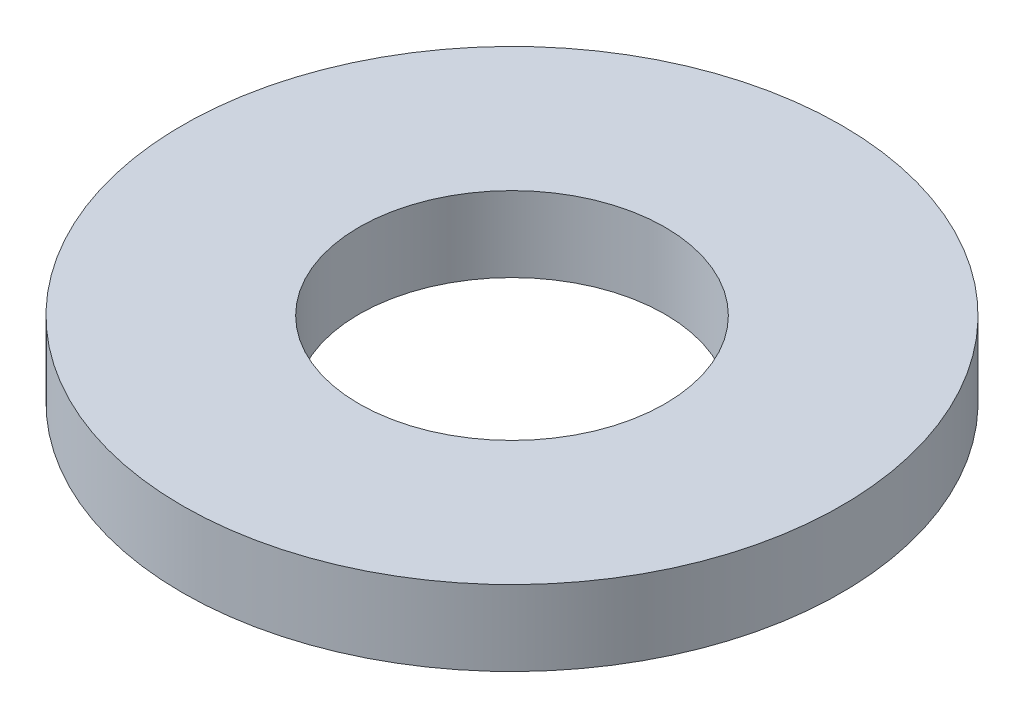
ISO-10303-21;
HEADER;
FILE_DESCRIPTION(('STEP AP214'),'2;1');
FILE_NAME('part.step','',(''),(''),'','','');
FILE_SCHEMA(('AUTOMOTIVE_DESIGN { 1 0 10303 214 1 1 1 1 }'));
ENDSEC;
DATA;
#1=APPLICATION_CONTEXT('core data for automotive mechanical design processes');
#2=APPLICATION_PROTOCOL_DEFINITION('international standard','automotive_design',2000,#1);
#3=PRODUCT_CONTEXT('',#1,'mechanical');
#4=PRODUCT('Part','Part','',(#3));
#5=PRODUCT_RELATED_PRODUCT_CATEGORY('part','',(#4));
#6=PRODUCT_DEFINITION_FORMATION('','',#4);
#7=PRODUCT_DEFINITION_CONTEXT('part definition',#1,'design');
#8=PRODUCT_DEFINITION('design','',#6,#7);
#9=PRODUCT_DEFINITION_SHAPE('','',#8);
#10=(LENGTH_UNIT() NAMED_UNIT(*) SI_UNIT(.MILLI.,.METRE.));
#11=(NAMED_UNIT(*) PLANE_ANGLE_UNIT() SI_UNIT($,.RADIAN.));
#12=(NAMED_UNIT(*) SI_UNIT($,.STERADIAN.) SOLID_ANGLE_UNIT());
#13=UNCERTAINTY_MEASURE_WITH_UNIT(LENGTH_MEASURE(1.E-05),#10,'distance_accuracy_value','');
#14=(GEOMETRIC_REPRESENTATION_CONTEXT(3) GLOBAL_UNCERTAINTY_ASSIGNED_CONTEXT((#13)) GLOBAL_UNIT_ASSIGNED_CONTEXT((#10,
#11,#12)) REPRESENTATION_CONTEXT('',''));
#15=CARTESIAN_POINT('',(0.,0.,0.));
#16=DIRECTION('',(0.,0.,1.));
#17=DIRECTION('',(1.,0.,0.));
#18=AXIS2_PLACEMENT_3D('',#15,#16,#17);
#19=CARTESIAN_POINT('',(0.,16.,0.));
#20=DIRECTION('',(0.,-1.,0.));
#21=DIRECTION('',(0.,0.,-1.));
#22=AXIS2_PLACEMENT_3D('',#19,#20,#21);
#23=CYLINDRICAL_SURFACE('',#22,70.);
#24=CARTESIAN_POINT('',(0.,16.,0.));
#25=DIRECTION('',(0.,1.,0.));
#26=DIRECTION('',(0.,0.,1.));
#27=AXIS2_PLACEMENT_3D('',#24,#25,#26);
#28=CIRCLE('',#27,70.);
#29=CARTESIAN_POINT('',(0.,16.,70.));
#30=VERTEX_POINT('',#29);
#31=EDGE_CURVE('E10',#30,#30,#28,.T.);
#32=ORIENTED_EDGE('',*,*,#31,.F.);
#33=EDGE_LOOP('',(#32));
#34=FACE_BOUND('',#33,.T.);
#35=CARTESIAN_POINT('',(0.,0.,0.));
#36=DIRECTION('',(0.,1.,0.));
#37=DIRECTION('',(0.,0.,1.));
#38=AXIS2_PLACEMENT_3D('',#35,#36,#37);
#39=CIRCLE('',#38,70.);
#40=CARTESIAN_POINT('',(0.,0.,70.));
#41=VERTEX_POINT('',#40);
#42=EDGE_CURVE('E37',#41,#41,#39,.T.);
#43=ORIENTED_EDGE('',*,*,#42,.T.);
#44=EDGE_LOOP('',(#43));
#45=FACE_BOUND('',#44,.T.);
#46=ADVANCED_FACE('F40',(#34,#45),#23,.T.);
#47=CARTESIAN_POINT('',(0.,16.,0.));
#48=DIRECTION('',(0.,1.,0.));
#49=DIRECTION('',(0.,0.,1.));
#50=AXIS2_PLACEMENT_3D('',#47,#48,#49);
#51=PLANE('',#50);
#52=CARTESIAN_POINT('',(0.,16.,0.));
#53=DIRECTION('',(0.,1.,0.));
#54=DIRECTION('',(0.,0.,1.));
#55=AXIS2_PLACEMENT_3D('',#52,#53,#54);
#56=CIRCLE('',#55,32.5);
#57=CARTESIAN_POINT('',(0.,16.,32.5));
#58=VERTEX_POINT('',#57);
#59=EDGE_CURVE('E50',#58,#58,#56,.T.);
#60=ORIENTED_EDGE('',*,*,#59,.F.);
#61=EDGE_LOOP('',(#60));
#62=FACE_BOUND('',#61,.T.);
#63=ORIENTED_EDGE('',*,*,#31,.T.);
#64=EDGE_LOOP('',(#63));
#65=FACE_BOUND('',#64,.T.);
#66=ADVANCED_FACE('F59',(#62,#65),#51,.T.);
#67=CARTESIAN_POINT('',(0.,0.,0.));
#68=DIRECTION('',(0.,1.,0.));
#69=DIRECTION('',(0.,0.,1.));
#70=AXIS2_PLACEMENT_3D('',#67,#68,#69);
#71=PLANE('',#70);
#72=CARTESIAN_POINT('',(0.,0.,0.));
#73=DIRECTION('',(0.,1.,0.));
#74=DIRECTION('',(0.,0.,1.));
#75=AXIS2_PLACEMENT_3D('',#72,#73,#74);
#76=CIRCLE('',#75,32.5);
#77=CARTESIAN_POINT('',(0.,0.,32.5));
#78=VERTEX_POINT('',#77);
#79=EDGE_CURVE('E47',#78,#78,#76,.T.);
#80=ORIENTED_EDGE('',*,*,#79,.T.);
#81=EDGE_LOOP('',(#80));
#82=FACE_BOUND('',#81,.T.);
#83=ORIENTED_EDGE('',*,*,#42,.F.);
#84=EDGE_LOOP('',(#83));
#85=FACE_BOUND('',#84,.T.);
#86=ADVANCED_FACE('F58',(#82,#85),#71,.F.);
#87=CARTESIAN_POINT('',(0.,16.,0.));
#88=DIRECTION('',(0.,-1.,0.));
#89=DIRECTION('',(0.,0.,-1.));
#90=AXIS2_PLACEMENT_3D('',#87,#88,#89);
#91=CYLINDRICAL_SURFACE('',#90,32.5);
#92=ORIENTED_EDGE('',*,*,#59,.T.);
#93=EDGE_LOOP('',(#92));
#94=FACE_BOUND('',#93,.T.);
#95=ORIENTED_EDGE('',*,*,#79,.F.);
#96=EDGE_LOOP('',(#95));
#97=FACE_BOUND('',#96,.T.);
#98=ADVANCED_FACE('F54',(#94,#97),#91,.F.);
#99=CLOSED_SHELL('',(#46,#66,#86,#98));
#100=MANIFOLD_SOLID_BREP('B2',#99);
#101=ADVANCED_BREP_SHAPE_REPRESENTATION('',(#18,#100),#14);
#102=SHAPE_DEFINITION_REPRESENTATION(#9,#101);
ENDSEC;
END-ISO-10303-21;
